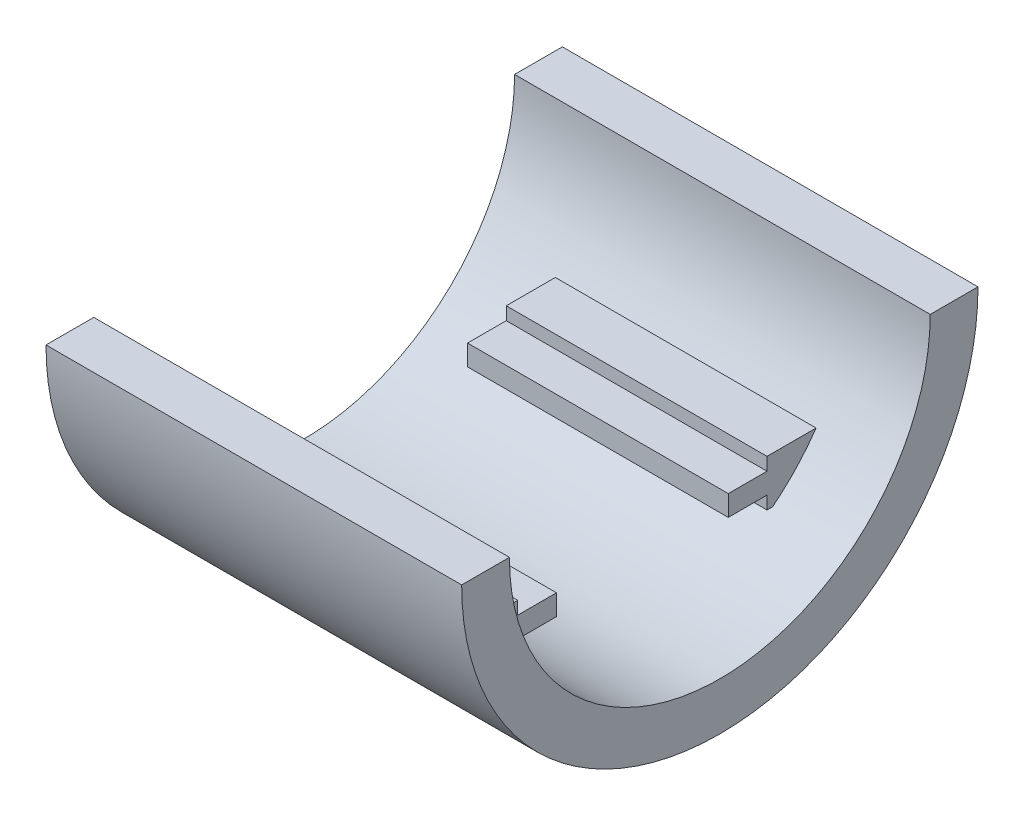
ISO-10303-21;
HEADER;
FILE_DESCRIPTION(('STEP AP214'),'2;1');
FILE_NAME('part.step','',(''),(''),'','','');
FILE_SCHEMA(('AUTOMOTIVE_DESIGN { 1 0 10303 214 1 1 1 1 }'));
ENDSEC;
DATA;
#1=APPLICATION_CONTEXT('core data for automotive mechanical design processes');
#2=APPLICATION_PROTOCOL_DEFINITION('international standard','automotive_design',2000,#1);
#3=PRODUCT_CONTEXT('',#1,'mechanical');
#4=PRODUCT('Part','Part','',(#3));
#5=PRODUCT_RELATED_PRODUCT_CATEGORY('part','',(#4));
#6=PRODUCT_DEFINITION_FORMATION('','',#4);
#7=PRODUCT_DEFINITION_CONTEXT('part definition',#1,'design');
#8=PRODUCT_DEFINITION('design','',#6,#7);
#9=PRODUCT_DEFINITION_SHAPE('','',#8);
#10=(LENGTH_UNIT() NAMED_UNIT(*) SI_UNIT(.MILLI.,.METRE.));
#11=(NAMED_UNIT(*) PLANE_ANGLE_UNIT() SI_UNIT($,.RADIAN.));
#12=(NAMED_UNIT(*) SI_UNIT($,.STERADIAN.) SOLID_ANGLE_UNIT());
#13=UNCERTAINTY_MEASURE_WITH_UNIT(LENGTH_MEASURE(1.E-05),#10,'distance_accuracy_value','');
#14=(GEOMETRIC_REPRESENTATION_CONTEXT(3) GLOBAL_UNCERTAINTY_ASSIGNED_CONTEXT((#13)) GLOBAL_UNIT_ASSIGNED_CONTEXT((#10,
#11,#12)) REPRESENTATION_CONTEXT('',''));
#15=CARTESIAN_POINT('',(0.,0.,0.));
#16=DIRECTION('',(0.,0.,1.));
#17=DIRECTION('',(1.,0.,0.));
#18=AXIS2_PLACEMENT_3D('',#15,#16,#17);
#19=CARTESIAN_POINT('',(33.274,-16.2560000000001,12.2624623357398));
#20=DIRECTION('',(0.,0.,1.));
#21=DIRECTION('',(1.,0.,0.));
#22=AXIS2_PLACEMENT_3D('',#19,#20,#21);
#23=PLANE('',#22);
#24=DIRECTION('',(-1.,0.,0.));
#25=VECTOR('',#24,1.);
#26=CARTESIAN_POINT('',(37.592,-14.9860000000001,12.2624623357398));
#27=LINE('',#26,#25);
#28=CARTESIAN_POINT('',(33.274,-14.9860000000001,12.2624623357398));
#29=VERTEX_POINT('',#28);
#30=CARTESIAN_POINT('',(7.62,-14.9860000000001,12.2624623357398));
#31=VERTEX_POINT('',#30);
#32=EDGE_CURVE('E197',#29,#31,#27,.T.);
#33=ORIENTED_EDGE('',*,*,#32,.F.);
#34=DIRECTION('',(0.,1.,0.));
#35=VECTOR('',#34,1.);
#36=CARTESIAN_POINT('',(33.274,-16.2560000000001,12.2624623357398));
#37=LINE('',#36,#35);
#38=CARTESIAN_POINT('',(33.274,-16.2560000000001,12.2624623357398));
#39=VERTEX_POINT('',#38);
#40=EDGE_CURVE('E241',#39,#29,#37,.T.);
#41=ORIENTED_EDGE('',*,*,#40,.F.);
#42=DIRECTION('',(1.,0.,0.));
#43=VECTOR('',#42,1.);
#44=CARTESIAN_POINT('',(33.274,-16.2560000000001,12.2624623357398));
#45=LINE('',#44,#43);
#46=CARTESIAN_POINT('',(7.62,-16.2560000000001,12.2624623357398));
#47=VERTEX_POINT('',#46);
#48=EDGE_CURVE('E233',#47,#39,#45,.T.);
#49=ORIENTED_EDGE('',*,*,#48,.F.);
#50=DIRECTION('',(0.,1.,0.));
#51=VECTOR('',#50,1.);
#52=CARTESIAN_POINT('',(7.62,-16.2560000000001,12.2624623357398));
#53=LINE('',#52,#51);
#54=EDGE_CURVE('E245',#47,#31,#53,.T.);
#55=ORIENTED_EDGE('',*,*,#54,.T.);
#56=EDGE_LOOP('',(#33,#41,#49,#55));
#57=FACE_BOUND('',#56,.T.);
#58=ADVANCED_FACE('F32',(#57),#23,.F.);
#59=CARTESIAN_POINT('',(33.274,-16.2560000000001,-12.2624623357398));
#60=DIRECTION('',(0.,0.,-1.));
#61=DIRECTION('',(-1.,0.,0.));
#62=AXIS2_PLACEMENT_3D('',#59,#60,#61);
#63=PLANE('',#62);
#64=DIRECTION('',(-1.,0.,0.));
#65=VECTOR('',#64,1.);
#66=CARTESIAN_POINT('',(37.592,-12.9540000000001,-12.2624623357398));
#67=LINE('',#66,#65);
#68=CARTESIAN_POINT('',(33.274,-12.9540000000001,-12.2624623357398));
#69=VERTEX_POINT('',#68);
#70=CARTESIAN_POINT('',(7.62,-12.9540000000001,-12.2624623357398));
#71=VERTEX_POINT('',#70);
#72=EDGE_CURVE('E208',#69,#71,#67,.T.);
#73=ORIENTED_EDGE('',*,*,#72,.F.);
#74=DIRECTION('',(0.,1.,0.));
#75=VECTOR('',#74,1.);
#76=CARTESIAN_POINT('',(33.274,-16.2560000000001,-12.2624623357398));
#77=LINE('',#76,#75);
#78=CARTESIAN_POINT('',(33.274,-11.6840000000001,-12.2624623357398));
#79=VERTEX_POINT('',#78);
#80=EDGE_CURVE('E237',#69,#79,#77,.T.);
#81=ORIENTED_EDGE('',*,*,#80,.T.);
#82=DIRECTION('',(-1.,0.,0.));
#83=VECTOR('',#82,1.);
#84=CARTESIAN_POINT('',(33.274,-11.6840000000001,-12.2624623357398));
#85=LINE('',#84,#83);
#86=CARTESIAN_POINT('',(7.62,-11.6840000000001,-12.2624623357398));
#87=VERTEX_POINT('',#86);
#88=EDGE_CURVE('E229',#79,#87,#85,.T.);
#89=ORIENTED_EDGE('',*,*,#88,.T.);
#90=DIRECTION('',(0.,1.,0.));
#91=VECTOR('',#90,1.);
#92=CARTESIAN_POINT('',(7.62,-16.2560000000001,-12.2624623357398));
#93=LINE('',#92,#91);
#94=EDGE_CURVE('E250',#71,#87,#93,.T.);
#95=ORIENTED_EDGE('',*,*,#94,.F.);
#96=EDGE_LOOP('',(#73,#81,#89,#95));
#97=FACE_BOUND('',#96,.T.);
#98=ADVANCED_FACE('F344',(#97),#63,.F.);
#99=CARTESIAN_POINT('',(33.274,-11.6840000000001,25.401));
#100=DIRECTION('',(-1.,0.,0.));
#101=DIRECTION('',(0.,0.,1.));
#102=AXIS2_PLACEMENT_3D('',#99,#100,#101);
#103=PLANE('',#102);
#104=DIRECTION('',(0.,0.,-1.));
#105=VECTOR('',#104,1.);
#106=CARTESIAN_POINT('',(33.274,-16.2560000000001,25.401));
#107=LINE('',#106,#105);
#108=CARTESIAN_POINT('',(33.274,-16.2560000000001,12.8169366464844));
#109=VERTEX_POINT('',#108);
#110=EDGE_CURVE('E273',#109,#39,#107,.T.);
#111=ORIENTED_EDGE('',*,*,#110,.T.);
#112=ORIENTED_EDGE('',*,*,#40,.T.);
#113=DIRECTION('',(0.,0.,-1.));
#114=VECTOR('',#113,1.);
#115=CARTESIAN_POINT('',(33.274,-14.9860000000001,12.2624623357398));
#116=LINE('',#115,#114);
#117=CARTESIAN_POINT('',(33.274,-14.9860000000001,8.45246233573977));
#118=VERTEX_POINT('',#117);
#119=EDGE_CURVE('E193',#29,#118,#116,.T.);
#120=ORIENTED_EDGE('',*,*,#119,.T.);
#121=DIRECTION('',(0.,1.,0.));
#122=VECTOR('',#121,1.);
#123=CARTESIAN_POINT('',(33.274,-12.9540000000001,8.45246233573977));
#124=LINE('',#123,#122);
#125=CARTESIAN_POINT('',(33.274,-12.9540000000001,8.45246233573977));
#126=VERTEX_POINT('',#125);
#127=EDGE_CURVE('E200',#118,#126,#124,.T.);
#128=ORIENTED_EDGE('',*,*,#127,.T.);
#129=DIRECTION('',(0.,0.,1.));
#130=VECTOR('',#129,1.);
#131=CARTESIAN_POINT('',(33.274,-12.9540000000001,12.2624623357398));
#132=LINE('',#131,#130);
#133=CARTESIAN_POINT('',(33.274,-12.9540000000001,12.2624623357398));
#134=VERTEX_POINT('',#133);
#135=EDGE_CURVE('E174',#126,#134,#132,.T.);
#136=ORIENTED_EDGE('',*,*,#135,.T.);
#137=CARTESIAN_POINT('',(33.274,-11.6840000000001,12.2624623357398));
#138=VERTEX_POINT('',#137);
#139=EDGE_CURVE('E52',#134,#138,#37,.T.);
#140=ORIENTED_EDGE('',*,*,#139,.T.);
#141=DIRECTION('',(0.,0.,-1.));
#142=VECTOR('',#141,1.);
#143=CARTESIAN_POINT('',(33.274,-11.6840000000001,25.401));
#144=LINE('',#143,#142);
#145=CARTESIAN_POINT('',(33.274,-11.6840000000001,17.0884623357398));
#146=VERTEX_POINT('',#145);
#147=EDGE_CURVE('E268',#146,#138,#144,.T.);
#148=ORIENTED_EDGE('',*,*,#147,.F.);
#149=CARTESIAN_POINT('',(33.274,0.,0.));
#150=DIRECTION('',(-1.,0.,0.));
#151=DIRECTION('',(0.,0.,1.));
#152=AXIS2_PLACEMENT_3D('',#149,#150,#151);
#153=CIRCLE('',#152,20.701);
#154=EDGE_CURVE('E270',#109,#146,#153,.T.);
#155=ORIENTED_EDGE('',*,*,#154,.F.);
#156=EDGE_LOOP('',(#111,#112,#120,#128,#136,#140,#148,#155));
#157=FACE_BOUND('',#156,.T.);
#158=ADVANCED_FACE('F351',(#157),#103,.F.);
#159=CARTESIAN_POINT('',(33.274,-11.6840000000001,25.401));
#160=DIRECTION('',(0.,-1.,0.));
#161=DIRECTION('',(1.,0.,0.));
#162=AXIS2_PLACEMENT_3D('',#159,#160,#161);
#163=PLANE('',#162);
#164=ORIENTED_EDGE('',*,*,#147,.T.);
#165=DIRECTION('',(1.,0.,0.));
#166=VECTOR('',#165,1.);
#167=CARTESIAN_POINT('',(33.274,-11.6840000000001,12.2624623357398));
#168=LINE('',#167,#166);
#169=CARTESIAN_POINT('',(7.62,-11.6840000000001,12.2624623357398));
#170=VERTEX_POINT('',#169);
#171=EDGE_CURVE('E234',#170,#138,#168,.T.);
#172=ORIENTED_EDGE('',*,*,#171,.F.);
#173=DIRECTION('',(0.,0.,-1.));
#174=VECTOR('',#173,1.);
#175=CARTESIAN_POINT('',(7.62,-11.6840000000001,25.401));
#176=LINE('',#175,#174);
#177=CARTESIAN_POINT('',(7.62,-11.6840000000001,17.0884623357398));
#178=VERTEX_POINT('',#177);
#179=EDGE_CURVE('E281',#178,#170,#176,.T.);
#180=ORIENTED_EDGE('',*,*,#179,.F.);
#181=DIRECTION('',(-1.,0.,0.));
#182=VECTOR('',#181,1.);
#183=CARTESIAN_POINT('',(0.,-11.6840000000001,17.0884623357398));
#184=LINE('',#183,#182);
#185=EDGE_CURVE('E267',#146,#178,#184,.T.);
#186=ORIENTED_EDGE('',*,*,#185,.F.);
#187=EDGE_LOOP('',(#164,#172,#180,#186));
#188=FACE_BOUND('',#187,.T.);
#189=ADVANCED_FACE('F381',(#188),#163,.F.);
#190=CARTESIAN_POINT('',(7.62,-11.6840000000001,25.401));
#191=DIRECTION('',(1.,0.,0.));
#192=DIRECTION('',(0.,1.,0.));
#193=AXIS2_PLACEMENT_3D('',#190,#191,#192);
#194=PLANE('',#193);
#195=ORIENTED_EDGE('',*,*,#179,.T.);
#196=CARTESIAN_POINT('',(7.62,-12.9540000000001,12.2624623357398));
#197=VERTEX_POINT('',#196);
#198=EDGE_CURVE('E190',#197,#170,#53,.T.);
#199=ORIENTED_EDGE('',*,*,#198,.F.);
#200=DIRECTION('',(0.,0.,-1.));
#201=VECTOR('',#200,1.);
#202=CARTESIAN_POINT('',(7.62,-12.9540000000001,12.2624623357398));
#203=LINE('',#202,#201);
#204=CARTESIAN_POINT('',(7.62,-12.9540000000001,8.45246233573977));
#205=VERTEX_POINT('',#204);
#206=EDGE_CURVE('E173',#197,#205,#203,.T.);
#207=ORIENTED_EDGE('',*,*,#206,.T.);
#208=DIRECTION('',(0.,-1.,0.));
#209=VECTOR('',#208,1.);
#210=CARTESIAN_POINT('',(7.62,-12.9540000000001,8.45246233573977));
#211=LINE('',#210,#209);
#212=CARTESIAN_POINT('',(7.62,-14.9860000000001,8.45246233573977));
#213=VERTEX_POINT('',#212);
#214=EDGE_CURVE('E180',#205,#213,#211,.T.);
#215=ORIENTED_EDGE('',*,*,#214,.T.);
#216=DIRECTION('',(0.,0.,1.));
#217=VECTOR('',#216,1.);
#218=CARTESIAN_POINT('',(7.62,-14.9860000000001,12.2624623357398));
#219=LINE('',#218,#217);
#220=EDGE_CURVE('E186',#213,#31,#219,.T.);
#221=ORIENTED_EDGE('',*,*,#220,.T.);
#222=ORIENTED_EDGE('',*,*,#54,.F.);
#223=DIRECTION('',(0.,0.,-1.));
#224=VECTOR('',#223,1.);
#225=CARTESIAN_POINT('',(7.62,-16.2560000000001,25.401));
#226=LINE('',#225,#224);
#227=CARTESIAN_POINT('',(7.62,-16.2560000000001,12.8169366464844));
#228=VERTEX_POINT('',#227);
#229=EDGE_CURVE('E277',#228,#47,#226,.T.);
#230=ORIENTED_EDGE('',*,*,#229,.F.);
#231=CARTESIAN_POINT('',(7.62,0.,0.));
#232=DIRECTION('',(1.,0.,0.));
#233=DIRECTION('',(0.,1.,0.));
#234=AXIS2_PLACEMENT_3D('',#231,#232,#233);
#235=CIRCLE('',#234,20.701);
#236=EDGE_CURVE('E265',#178,#228,#235,.T.);
#237=ORIENTED_EDGE('',*,*,#236,.F.);
#238=EDGE_LOOP('',(#195,#199,#207,#215,#221,#222,#230,#237));
#239=FACE_BOUND('',#238,.T.);
#240=ADVANCED_FACE('F189',(#239),#194,.F.);
#241=CARTESIAN_POINT('',(33.274,-16.2560000000001,25.401));
#242=DIRECTION('',(0.,1.,0.));
#243=DIRECTION('',(-1.,0.,0.));
#244=AXIS2_PLACEMENT_3D('',#241,#242,#243);
#245=PLANE('',#244);
#246=ORIENTED_EDGE('',*,*,#229,.T.);
#247=ORIENTED_EDGE('',*,*,#48,.T.);
#248=ORIENTED_EDGE('',*,*,#110,.F.);
#249=DIRECTION('',(-1.,0.,0.));
#250=VECTOR('',#249,1.);
#251=CARTESIAN_POINT('',(0.,-16.2560000000001,12.8169366464844));
#252=LINE('',#251,#250);
#253=EDGE_CURVE('E272',#228,#109,#252,.F.);
#254=ORIENTED_EDGE('',*,*,#253,.F.);
#255=EDGE_LOOP('',(#246,#247,#248,#254));
#256=FACE_BOUND('',#255,.T.);
#257=ADVANCED_FACE('F338',(#256),#245,.F.);
#258=CARTESIAN_POINT('',(0.,0.,0.));
#259=DIRECTION('',(-1.,0.,0.));
#260=DIRECTION('',(0.,0.,1.));
#261=AXIS2_PLACEMENT_3D('',#258,#259,#260);
#262=CYLINDRICAL_SURFACE('',#261,20.701);
#263=ORIENTED_EDGE('',*,*,#154,.T.);
#264=ORIENTED_EDGE('',*,*,#185,.T.);
#265=ORIENTED_EDGE('',*,*,#236,.T.);
#266=ORIENTED_EDGE('',*,*,#253,.T.);
#267=EDGE_LOOP('',(#263,#264,#265,#266));
#268=FACE_BOUND('',#267,.T.);
#269=CARTESIAN_POINT('',(40.894,0.,0.));
#270=DIRECTION('',(1.,0.,0.));
#271=DIRECTION('',(0.,0.,-1.));
#272=AXIS2_PLACEMENT_3D('',#269,#270,#271);
#273=CIRCLE('',#272,20.701);
#274=CARTESIAN_POINT('',(40.894,-1.44554310390783E-13,20.701));
#275=VERTEX_POINT('',#274);
#276=CARTESIAN_POINT('',(40.894,1.44554310390783E-13,-20.701));
#277=VERTEX_POINT('',#276);
#278=EDGE_CURVE('E289',#275,#277,#273,.T.);
#279=ORIENTED_EDGE('',*,*,#278,.T.);
#280=DIRECTION('',(-1.,0.,0.));
#281=VECTOR('',#280,1.);
#282=CARTESIAN_POINT('',(0.,1.44554310390783E-13,-20.701));
#283=LINE('',#282,#281);
#284=CARTESIAN_POINT('',(0.,1.44554310390783E-13,-20.701));
#285=VERTEX_POINT('',#284);
#286=EDGE_CURVE('E40',#285,#277,#283,.F.);
#287=ORIENTED_EDGE('',*,*,#286,.F.);
#288=CARTESIAN_POINT('',(0.,0.,0.));
#289=DIRECTION('',(-1.,0.,0.));
#290=DIRECTION('',(0.,0.,1.));
#291=AXIS2_PLACEMENT_3D('',#288,#289,#290);
#292=CIRCLE('',#291,20.701);
#293=CARTESIAN_POINT('',(0.,0.,20.701));
#294=VERTEX_POINT('',#293);
#295=EDGE_CURVE('E287',#285,#294,#292,.T.);
#296=ORIENTED_EDGE('',*,*,#295,.T.);
#297=DIRECTION('',(-1.,0.,0.));
#298=VECTOR('',#297,1.);
#299=CARTESIAN_POINT('',(0.,-1.44554310390783E-13,20.701));
#300=LINE('',#299,#298);
#301=EDGE_CURVE('E11',#275,#294,#300,.T.);
#302=ORIENTED_EDGE('',*,*,#301,.F.);
#303=EDGE_LOOP('',(#279,#287,#296,#302));
#304=FACE_BOUND('',#303,.T.);
#305=CARTESIAN_POINT('',(33.274,0.,0.));
#306=DIRECTION('',(1.,0.,0.));
#307=DIRECTION('',(0.,0.,-1.));
#308=AXIS2_PLACEMENT_3D('',#305,#306,#307);
#309=CIRCLE('',#308,20.701);
#310=CARTESIAN_POINT('',(33.274,-16.2560000000001,-12.8169366464844));
#311=VERTEX_POINT('',#310);
#312=CARTESIAN_POINT('',(33.274,-11.6840000000001,-17.0884623357398));
#313=VERTEX_POINT('',#312);
#314=EDGE_CURVE('E259',#311,#313,#309,.T.);
#315=ORIENTED_EDGE('',*,*,#314,.F.);
#316=DIRECTION('',(-1.,0.,0.));
#317=VECTOR('',#316,1.);
#318=CARTESIAN_POINT('',(0.,-16.2560000000001,-12.8169366464844));
#319=LINE('',#318,#317);
#320=CARTESIAN_POINT('',(7.62,-16.2560000000001,-12.8169366464844));
#321=VERTEX_POINT('',#320);
#322=EDGE_CURVE('E256',#321,#311,#319,.F.);
#323=ORIENTED_EDGE('',*,*,#322,.F.);
#324=CARTESIAN_POINT('',(7.62,0.,0.));
#325=DIRECTION('',(-1.,0.,0.));
#326=DIRECTION('',(0.,-1.,0.));
#327=AXIS2_PLACEMENT_3D('',#324,#325,#326);
#328=CIRCLE('',#327,20.701);
#329=CARTESIAN_POINT('',(7.62,-11.6840000000001,-17.0884623357398));
#330=VERTEX_POINT('',#329);
#331=EDGE_CURVE('E253',#330,#321,#328,.T.);
#332=ORIENTED_EDGE('',*,*,#331,.F.);
#333=DIRECTION('',(-1.,0.,0.));
#334=VECTOR('',#333,1.);
#335=CARTESIAN_POINT('',(0.,-11.6840000000001,-17.0884623357398));
#336=LINE('',#335,#334);
#337=EDGE_CURVE('E244',#313,#330,#336,.T.);
#338=ORIENTED_EDGE('',*,*,#337,.F.);
#339=EDGE_LOOP('',(#315,#323,#332,#338));
#340=FACE_BOUND('',#339,.T.);
#341=ADVANCED_FACE('F327',(#268,#304,#340),#262,.F.);
#342=CARTESIAN_POINT('',(0.,0.,0.));
#343=DIRECTION('',(0.,-1.,0.));
#344=DIRECTION('',(0.,0.,-1.));
#345=AXIS2_PLACEMENT_3D('',#342,#343,#344);
#346=PLANE('',#345);
#347=DIRECTION('',(0.,0.,1.));
#348=VECTOR('',#347,1.);
#349=CARTESIAN_POINT('',(40.894,0.,0.));
#350=LINE('',#349,#348);
#351=CARTESIAN_POINT('',(40.894,0.,25.4));
#352=VERTEX_POINT('',#351);
#353=EDGE_CURVE('E301',#275,#352,#350,.T.);
#354=ORIENTED_EDGE('',*,*,#353,.F.);
#355=ORIENTED_EDGE('',*,*,#301,.T.);
#356=DIRECTION('',(0.,0.,-1.));
#357=VECTOR('',#356,1.);
#358=CARTESIAN_POINT('',(0.,0.,0.));
#359=LINE('',#358,#357);
#360=CARTESIAN_POINT('',(0.,0.,25.4));
#361=VERTEX_POINT('',#360);
#362=EDGE_CURVE('E295',#361,#294,#359,.T.);
#363=ORIENTED_EDGE('',*,*,#362,.F.);
#364=DIRECTION('',(1.,0.,0.));
#365=VECTOR('',#364,1.);
#366=CARTESIAN_POINT('',(0.,0.,25.4));
#367=LINE('',#366,#365);
#368=EDGE_CURVE('E291',#361,#352,#367,.T.);
#369=ORIENTED_EDGE('',*,*,#368,.T.);
#370=EDGE_LOOP('',(#354,#355,#363,#369));
#371=FACE_BOUND('',#370,.T.);
#372=ADVANCED_FACE('F330',(#371),#346,.F.);
#373=CARTESIAN_POINT('',(0.,0.,0.));
#374=DIRECTION('',(-1.,0.,0.));
#375=DIRECTION('',(0.,0.,1.));
#376=AXIS2_PLACEMENT_3D('',#373,#374,#375);
#377=PLANE('',#376);
#378=ORIENTED_EDGE('',*,*,#295,.F.);
#379=CARTESIAN_POINT('',(0.,1.77367252013231E-13,-25.4));
#380=VERTEX_POINT('',#379);
#381=EDGE_CURVE('E294',#285,#380,#359,.T.);
#382=ORIENTED_EDGE('',*,*,#381,.T.);
#383=CARTESIAN_POINT('',(0.,0.,0.));
#384=DIRECTION('',(-1.,0.,0.));
#385=DIRECTION('',(0.,0.,1.));
#386=AXIS2_PLACEMENT_3D('',#383,#384,#385);
#387=CIRCLE('',#386,25.4);
#388=EDGE_CURVE('E308',#380,#361,#387,.T.);
#389=ORIENTED_EDGE('',*,*,#388,.T.);
#390=ORIENTED_EDGE('',*,*,#362,.T.);
#391=EDGE_LOOP('',(#378,#382,#389,#390));
#392=FACE_BOUND('',#391,.T.);
#393=ADVANCED_FACE('F326',(#392),#377,.T.);
#394=CARTESIAN_POINT('',(0.,0.,0.));
#395=DIRECTION('',(-1.,0.,0.));
#396=DIRECTION('',(0.,0.,1.));
#397=AXIS2_PLACEMENT_3D('',#394,#395,#396);
#398=CYLINDRICAL_SURFACE('',#397,25.4);
#399=CARTESIAN_POINT('',(40.894,0.,0.));
#400=DIRECTION('',(-1.,0.,0.));
#401=DIRECTION('',(0.,0.,1.));
#402=AXIS2_PLACEMENT_3D('',#399,#400,#401);
#403=CIRCLE('',#402,25.4);
#404=CARTESIAN_POINT('',(40.894,1.77367252013231E-13,-25.4));
#405=VERTEX_POINT('',#404);
#406=EDGE_CURVE('E305',#405,#352,#403,.T.);
#407=ORIENTED_EDGE('',*,*,#406,.T.);
#408=ORIENTED_EDGE('',*,*,#368,.F.);
#409=ORIENTED_EDGE('',*,*,#388,.F.);
#410=DIRECTION('',(1.,0.,0.));
#411=VECTOR('',#410,1.);
#412=CARTESIAN_POINT('',(0.,1.77367252013231E-13,-25.4));
#413=LINE('',#412,#411);
#414=EDGE_CURVE('E298',#380,#405,#413,.T.);
#415=ORIENTED_EDGE('',*,*,#414,.T.);
#416=EDGE_LOOP('',(#407,#408,#409,#415));
#417=FACE_BOUND('',#416,.T.);
#418=ADVANCED_FACE('F34',(#417),#398,.T.);
#419=CARTESIAN_POINT('',(40.894,0.,0.));
#420=DIRECTION('',(1.,0.,0.));
#421=DIRECTION('',(0.,0.,-1.));
#422=AXIS2_PLACEMENT_3D('',#419,#420,#421);
#423=PLANE('',#422);
#424=ORIENTED_EDGE('',*,*,#278,.F.);
#425=ORIENTED_EDGE('',*,*,#353,.T.);
#426=ORIENTED_EDGE('',*,*,#406,.F.);
#427=EDGE_CURVE('E302',#405,#277,#350,.T.);
#428=ORIENTED_EDGE('',*,*,#427,.T.);
#429=EDGE_LOOP('',(#424,#425,#426,#428));
#430=FACE_BOUND('',#429,.T.);
#431=ADVANCED_FACE('F320',(#430),#423,.T.);
#432=ORIENTED_EDGE('',*,*,#381,.F.);
#433=ORIENTED_EDGE('',*,*,#286,.T.);
#434=ORIENTED_EDGE('',*,*,#427,.F.);
#435=ORIENTED_EDGE('',*,*,#414,.F.);
#436=EDGE_LOOP('',(#432,#433,#434,#435));
#437=FACE_BOUND('',#436,.T.);
#438=ADVANCED_FACE('F314',(#437),#346,.F.);
#439=EDGE_CURVE('E283',#79,#313,#144,.T.);
#440=ORIENTED_EDGE('',*,*,#439,.F.);
#441=ORIENTED_EDGE('',*,*,#80,.F.);
#442=DIRECTION('',(0.,0.,1.));
#443=VECTOR('',#442,1.);
#444=CARTESIAN_POINT('',(33.274,-12.9540000000001,-12.2624623357398));
#445=LINE('',#444,#443);
#446=CARTESIAN_POINT('',(33.274,-12.9540000000001,-8.45246233573977));
#447=VERTEX_POINT('',#446);
#448=EDGE_CURVE('E207',#69,#447,#445,.T.);
#449=ORIENTED_EDGE('',*,*,#448,.T.);
#450=DIRECTION('',(0.,-1.,0.));
#451=VECTOR('',#450,1.);
#452=CARTESIAN_POINT('',(33.274,-12.9540000000001,-8.45246233573977));
#453=LINE('',#452,#451);
#454=CARTESIAN_POINT('',(33.274,-14.9860000000001,-8.45246233573976));
#455=VERTEX_POINT('',#454);
#456=EDGE_CURVE('E205',#447,#455,#453,.T.);
#457=ORIENTED_EDGE('',*,*,#456,.T.);
#458=DIRECTION('',(0.,0.,-1.));
#459=VECTOR('',#458,1.);
#460=CARTESIAN_POINT('',(33.274,-14.9860000000001,-12.2624623357398));
#461=LINE('',#460,#459);
#462=CARTESIAN_POINT('',(33.274,-14.9860000000001,-12.2624623357398));
#463=VERTEX_POINT('',#462);
#464=EDGE_CURVE('E210',#455,#463,#461,.T.);
#465=ORIENTED_EDGE('',*,*,#464,.T.);
#466=CARTESIAN_POINT('',(33.274,-16.2560000000001,-12.2624623357398));
#467=VERTEX_POINT('',#466);
#468=EDGE_CURVE('E251',#467,#463,#77,.T.);
#469=ORIENTED_EDGE('',*,*,#468,.F.);
#470=EDGE_CURVE('E262',#467,#311,#107,.T.);
#471=ORIENTED_EDGE('',*,*,#470,.T.);
#472=ORIENTED_EDGE('',*,*,#314,.T.);
#473=EDGE_LOOP('',(#440,#441,#449,#457,#465,#469,#471,#472));
#474=FACE_BOUND('',#473,.T.);
#475=ADVANCED_FACE('F342',(#474),#103,.F.);
#476=EDGE_CURVE('E280',#87,#330,#176,.T.);
#477=ORIENTED_EDGE('',*,*,#476,.F.);
#478=ORIENTED_EDGE('',*,*,#88,.F.);
#479=ORIENTED_EDGE('',*,*,#439,.T.);
#480=ORIENTED_EDGE('',*,*,#337,.T.);
#481=EDGE_LOOP('',(#477,#478,#479,#480));
#482=FACE_BOUND('',#481,.T.);
#483=ADVANCED_FACE('F376',(#482),#163,.F.);
#484=CARTESIAN_POINT('',(7.62,-16.2560000000001,-12.2624623357397));
#485=VERTEX_POINT('',#484);
#486=EDGE_CURVE('E276',#485,#321,#226,.T.);
#487=ORIENTED_EDGE('',*,*,#486,.F.);
#488=CARTESIAN_POINT('',(7.62,-14.9860000000001,-12.2624623357398));
#489=VERTEX_POINT('',#488);
#490=EDGE_CURVE('E247',#485,#489,#93,.T.);
#491=ORIENTED_EDGE('',*,*,#490,.T.);
#492=DIRECTION('',(0.,0.,1.));
#493=VECTOR('',#492,1.);
#494=CARTESIAN_POINT('',(7.62,-14.9860000000001,-12.2624623357398));
#495=LINE('',#494,#493);
#496=CARTESIAN_POINT('',(7.62,-14.9860000000001,-8.45246233573976));
#497=VERTEX_POINT('',#496);
#498=EDGE_CURVE('E204',#489,#497,#495,.T.);
#499=ORIENTED_EDGE('',*,*,#498,.T.);
#500=DIRECTION('',(0.,1.,0.));
#501=VECTOR('',#500,1.);
#502=CARTESIAN_POINT('',(7.62,-12.9540000000001,-8.45246233573977));
#503=LINE('',#502,#501);
#504=CARTESIAN_POINT('',(7.62,-12.9540000000001,-8.45246233573977));
#505=VERTEX_POINT('',#504);
#506=EDGE_CURVE('E213',#497,#505,#503,.T.);
#507=ORIENTED_EDGE('',*,*,#506,.T.);
#508=DIRECTION('',(0.,0.,-1.));
#509=VECTOR('',#508,1.);
#510=CARTESIAN_POINT('',(7.62,-12.9540000000001,-12.2624623357398));
#511=LINE('',#510,#509);
#512=EDGE_CURVE('E216',#505,#71,#511,.T.);
#513=ORIENTED_EDGE('',*,*,#512,.T.);
#514=ORIENTED_EDGE('',*,*,#94,.T.);
#515=ORIENTED_EDGE('',*,*,#476,.T.);
#516=ORIENTED_EDGE('',*,*,#331,.T.);
#517=EDGE_LOOP('',(#487,#491,#499,#507,#513,#514,#515,#516));
#518=FACE_BOUND('',#517,.T.);
#519=ADVANCED_FACE('F370',(#518),#194,.F.);
#520=ORIENTED_EDGE('',*,*,#470,.F.);
#521=DIRECTION('',(-1.,0.,0.));
#522=VECTOR('',#521,1.);
#523=CARTESIAN_POINT('',(33.274,-16.2560000000001,-12.2624623357398));
#524=LINE('',#523,#522);
#525=EDGE_CURVE('E230',#467,#485,#524,.T.);
#526=ORIENTED_EDGE('',*,*,#525,.T.);
#527=ORIENTED_EDGE('',*,*,#486,.T.);
#528=ORIENTED_EDGE('',*,*,#322,.T.);
#529=EDGE_LOOP('',(#520,#526,#527,#528));
#530=FACE_BOUND('',#529,.T.);
#531=ADVANCED_FACE('F365',(#530),#245,.F.);
#532=ORIENTED_EDGE('',*,*,#468,.T.);
#533=DIRECTION('',(-1.,0.,0.));
#534=VECTOR('',#533,1.);
#535=CARTESIAN_POINT('',(37.592,-14.9860000000001,-12.2624623357398));
#536=LINE('',#535,#534);
#537=EDGE_CURVE('E219',#463,#489,#536,.T.);
#538=ORIENTED_EDGE('',*,*,#537,.T.);
#539=ORIENTED_EDGE('',*,*,#490,.F.);
#540=ORIENTED_EDGE('',*,*,#525,.F.);
#541=EDGE_LOOP('',(#532,#538,#539,#540));
#542=FACE_BOUND('',#541,.T.);
#543=ADVANCED_FACE('F354',(#542),#63,.F.);
#544=ORIENTED_EDGE('',*,*,#139,.F.);
#545=DIRECTION('',(-1.,0.,0.));
#546=VECTOR('',#545,1.);
#547=CARTESIAN_POINT('',(37.592,-12.9540000000001,12.2624623357398));
#548=LINE('',#547,#546);
#549=EDGE_CURVE('E47',#134,#197,#548,.T.);
#550=ORIENTED_EDGE('',*,*,#549,.T.);
#551=ORIENTED_EDGE('',*,*,#198,.T.);
#552=ORIENTED_EDGE('',*,*,#171,.T.);
#553=EDGE_LOOP('',(#544,#550,#551,#552));
#554=FACE_BOUND('',#553,.T.);
#555=ADVANCED_FACE('F347',(#554),#23,.F.);
#556=CARTESIAN_POINT('',(37.592,-12.9540000000001,-12.2624623357398));
#557=DIRECTION('',(0.,1.,0.));
#558=DIRECTION('',(0.,0.,1.));
#559=AXIS2_PLACEMENT_3D('',#556,#557,#558);
#560=PLANE('',#559);
#561=ORIENTED_EDGE('',*,*,#448,.F.);
#562=ORIENTED_EDGE('',*,*,#72,.T.);
#563=ORIENTED_EDGE('',*,*,#512,.F.);
#564=DIRECTION('',(-1.,0.,0.));
#565=VECTOR('',#564,1.);
#566=CARTESIAN_POINT('',(37.592,-12.9540000000001,-8.45246233573977));
#567=LINE('',#566,#565);
#568=EDGE_CURVE('E222',#447,#505,#567,.T.);
#569=ORIENTED_EDGE('',*,*,#568,.F.);
#570=EDGE_LOOP('',(#561,#562,#563,#569));
#571=FACE_BOUND('',#570,.T.);
#572=ADVANCED_FACE('F357',(#571),#560,.T.);
#573=CARTESIAN_POINT('',(37.592,-12.9540000000001,-8.45246233573977));
#574=DIRECTION('',(0.,0.,1.));
#575=DIRECTION('',(0.,-1.,0.));
#576=AXIS2_PLACEMENT_3D('',#573,#574,#575);
#577=PLANE('',#576);
#578=ORIENTED_EDGE('',*,*,#456,.F.);
#579=ORIENTED_EDGE('',*,*,#568,.T.);
#580=ORIENTED_EDGE('',*,*,#506,.F.);
#581=DIRECTION('',(-1.,0.,0.));
#582=VECTOR('',#581,1.);
#583=CARTESIAN_POINT('',(37.592,-14.9860000000001,-8.45246233573976));
#584=LINE('',#583,#582);
#585=EDGE_CURVE('E224',#455,#497,#584,.T.);
#586=ORIENTED_EDGE('',*,*,#585,.F.);
#587=EDGE_LOOP('',(#578,#579,#580,#586));
#588=FACE_BOUND('',#587,.T.);
#589=ADVANCED_FACE('F362',(#588),#577,.T.);
#590=CARTESIAN_POINT('',(37.592,-14.9860000000001,-12.2624623357398));
#591=DIRECTION('',(0.,-1.,0.));
#592=DIRECTION('',(0.,0.,-1.));
#593=AXIS2_PLACEMENT_3D('',#590,#591,#592);
#594=PLANE('',#593);
#595=ORIENTED_EDGE('',*,*,#464,.F.);
#596=ORIENTED_EDGE('',*,*,#585,.T.);
#597=ORIENTED_EDGE('',*,*,#498,.F.);
#598=ORIENTED_EDGE('',*,*,#537,.F.);
#599=EDGE_LOOP('',(#595,#596,#597,#598));
#600=FACE_BOUND('',#599,.T.);
#601=ADVANCED_FACE('F408',(#600),#594,.T.);
#602=CARTESIAN_POINT('',(37.592,-14.9860000000001,12.2624623357398));
#603=DIRECTION('',(0.,-1.,0.));
#604=DIRECTION('',(0.,0.,-1.));
#605=AXIS2_PLACEMENT_3D('',#602,#603,#604);
#606=PLANE('',#605);
#607=ORIENTED_EDGE('',*,*,#119,.F.);
#608=ORIENTED_EDGE('',*,*,#32,.T.);
#609=ORIENTED_EDGE('',*,*,#220,.F.);
#610=DIRECTION('',(-1.,0.,0.));
#611=VECTOR('',#610,1.);
#612=CARTESIAN_POINT('',(37.592,-14.9860000000001,8.45246233573977));
#613=LINE('',#612,#611);
#614=EDGE_CURVE('E177',#118,#213,#613,.T.);
#615=ORIENTED_EDGE('',*,*,#614,.F.);
#616=EDGE_LOOP('',(#607,#608,#609,#615));
#617=FACE_BOUND('',#616,.T.);
#618=ADVANCED_FACE('F403',(#617),#606,.T.);
#619=CARTESIAN_POINT('',(37.592,-12.9540000000001,8.45246233573977));
#620=DIRECTION('',(0.,0.,-1.));
#621=DIRECTION('',(-1.,0.,0.));
#622=AXIS2_PLACEMENT_3D('',#619,#620,#621);
#623=PLANE('',#622);
#624=ORIENTED_EDGE('',*,*,#127,.F.);
#625=ORIENTED_EDGE('',*,*,#614,.T.);
#626=ORIENTED_EDGE('',*,*,#214,.F.);
#627=DIRECTION('',(-1.,0.,0.));
#628=VECTOR('',#627,1.);
#629=CARTESIAN_POINT('',(37.592,-12.9540000000001,8.45246233573977));
#630=LINE('',#629,#628);
#631=EDGE_CURVE('E169',#126,#205,#630,.T.);
#632=ORIENTED_EDGE('',*,*,#631,.F.);
#633=EDGE_LOOP('',(#624,#625,#626,#632));
#634=FACE_BOUND('',#633,.T.);
#635=ADVANCED_FACE('F181',(#634),#623,.T.);
#636=CARTESIAN_POINT('',(37.592,-12.9540000000001,12.2624623357398));
#637=DIRECTION('',(0.,1.,0.));
#638=DIRECTION('',(-1.,0.,0.));
#639=AXIS2_PLACEMENT_3D('',#636,#637,#638);
#640=PLANE('',#639);
#641=ORIENTED_EDGE('',*,*,#135,.F.);
#642=ORIENTED_EDGE('',*,*,#631,.T.);
#643=ORIENTED_EDGE('',*,*,#206,.F.);
#644=ORIENTED_EDGE('',*,*,#549,.F.);
#645=EDGE_LOOP('',(#641,#642,#643,#644));
#646=FACE_BOUND('',#645,.T.);
#647=ADVANCED_FACE('F171',(#646),#640,.T.);
#648=CLOSED_SHELL('',(#58,#98,#158,#189,#240,#257,#341,#372,#393,#418,#431,#438,#475,#483,#519,
#531,#543,#555,#572,#589,#601,#618,#635,#647));
#649=MANIFOLD_SOLID_BREP('B2',#648);
#650=ADVANCED_BREP_SHAPE_REPRESENTATION('',(#18,#649),#14);
#651=SHAPE_DEFINITION_REPRESENTATION(#9,#650);
ENDSEC;
END-ISO-10303-21;
